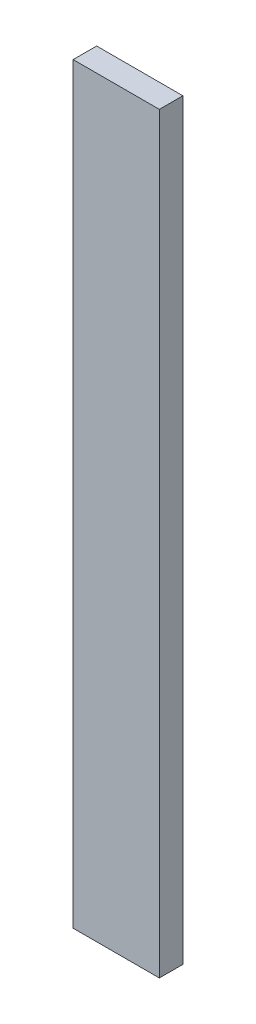
ISO-10303-21;
HEADER;
FILE_DESCRIPTION(('STEP AP214'),'2;1');
FILE_NAME('part.step','',(''),(''),'','','');
FILE_SCHEMA(('AUTOMOTIVE_DESIGN { 1 0 10303 214 1 1 1 1 }'));
ENDSEC;
DATA;
#1=APPLICATION_CONTEXT('core data for automotive mechanical design processes');
#2=APPLICATION_PROTOCOL_DEFINITION('international standard','automotive_design',2000,#1);
#3=PRODUCT_CONTEXT('',#1,'mechanical');
#4=PRODUCT('Part','Part','',(#3));
#5=PRODUCT_RELATED_PRODUCT_CATEGORY('part','',(#4));
#6=PRODUCT_DEFINITION_FORMATION('','',#4);
#7=PRODUCT_DEFINITION_CONTEXT('part definition',#1,'design');
#8=PRODUCT_DEFINITION('design','',#6,#7);
#9=PRODUCT_DEFINITION_SHAPE('','',#8);
#10=(LENGTH_UNIT() NAMED_UNIT(*) SI_UNIT(.MILLI.,.METRE.));
#11=(NAMED_UNIT(*) PLANE_ANGLE_UNIT() SI_UNIT($,.RADIAN.));
#12=(NAMED_UNIT(*) SI_UNIT($,.STERADIAN.) SOLID_ANGLE_UNIT());
#13=UNCERTAINTY_MEASURE_WITH_UNIT(LENGTH_MEASURE(1.E-05),#10,'distance_accuracy_value','');
#14=(GEOMETRIC_REPRESENTATION_CONTEXT(3) GLOBAL_UNCERTAINTY_ASSIGNED_CONTEXT((#13)) GLOBAL_UNIT_ASSIGNED_CONTEXT((#10,
#11,#12)) REPRESENTATION_CONTEXT('',''));
#15=CARTESIAN_POINT('',(0.,0.,0.));
#16=DIRECTION('',(0.,0.,1.));
#17=DIRECTION('',(1.,0.,0.));
#18=AXIS2_PLACEMENT_3D('',#15,#16,#17);
#19=CARTESIAN_POINT('',(-69.85,1219.2,19.05));
#20=DIRECTION('',(-1.,0.,0.));
#21=DIRECTION('',(0.,0.,1.));
#22=AXIS2_PLACEMENT_3D('',#19,#20,#21);
#23=PLANE('',#22);
#24=DIRECTION('',(0.,0.,-1.));
#25=VECTOR('',#24,1.);
#26=CARTESIAN_POINT('',(-69.85,0.,19.05));
#27=LINE('',#26,#25);
#28=CARTESIAN_POINT('',(-69.85,0.,19.05));
#29=VERTEX_POINT('',#28);
#30=CARTESIAN_POINT('',(-69.85,0.,-19.05));
#31=VERTEX_POINT('',#30);
#32=EDGE_CURVE('E104',#29,#31,#27,.T.);
#33=ORIENTED_EDGE('',*,*,#32,.F.);
#34=DIRECTION('',(0.,-1.,0.));
#35=VECTOR('',#34,1.);
#36=CARTESIAN_POINT('',(-69.85,1219.2,19.05));
#37=LINE('',#36,#35);
#38=CARTESIAN_POINT('',(-69.85,1219.2,19.05));
#39=VERTEX_POINT('',#38);
#40=EDGE_CURVE('E11',#39,#29,#37,.T.);
#41=ORIENTED_EDGE('',*,*,#40,.F.);
#42=DIRECTION('',(0.,0.,-1.));
#43=VECTOR('',#42,1.);
#44=CARTESIAN_POINT('',(-69.85,1219.2,19.05));
#45=LINE('',#44,#43);
#46=CARTESIAN_POINT('',(-69.85,1219.2,-19.05));
#47=VERTEX_POINT('',#46);
#48=EDGE_CURVE('E99',#39,#47,#45,.T.);
#49=ORIENTED_EDGE('',*,*,#48,.T.);
#50=DIRECTION('',(0.,-1.,0.));
#51=VECTOR('',#50,1.);
#52=CARTESIAN_POINT('',(-69.85,1219.2,-19.05));
#53=LINE('',#52,#51);
#54=EDGE_CURVE('E42',#47,#31,#53,.T.);
#55=ORIENTED_EDGE('',*,*,#54,.T.);
#56=EDGE_LOOP('',(#33,#41,#49,#55));
#57=FACE_BOUND('',#56,.T.);
#58=ADVANCED_FACE('F39',(#57),#23,.T.);
#59=CARTESIAN_POINT('',(-69.85,1219.2,19.05));
#60=DIRECTION('',(0.,0.,-1.));
#61=DIRECTION('',(-1.,0.,0.));
#62=AXIS2_PLACEMENT_3D('',#59,#60,#61);
#63=PLANE('',#62);
#64=DIRECTION('',(1.,0.,0.));
#65=VECTOR('',#64,1.);
#66=CARTESIAN_POINT('',(-69.85,0.,19.05));
#67=LINE('',#66,#65);
#68=CARTESIAN_POINT('',(69.85,0.,19.05));
#69=VERTEX_POINT('',#68);
#70=EDGE_CURVE('E72',#29,#69,#67,.T.);
#71=ORIENTED_EDGE('',*,*,#70,.T.);
#72=DIRECTION('',(0.,-1.,0.));
#73=VECTOR('',#72,1.);
#74=CARTESIAN_POINT('',(69.85,1219.2,19.05));
#75=LINE('',#74,#73);
#76=CARTESIAN_POINT('',(69.85,1219.2,19.05));
#77=VERTEX_POINT('',#76);
#78=EDGE_CURVE('E48',#77,#69,#75,.T.);
#79=ORIENTED_EDGE('',*,*,#78,.F.);
#80=DIRECTION('',(1.,0.,0.));
#81=VECTOR('',#80,1.);
#82=CARTESIAN_POINT('',(-69.85,1219.2,19.05));
#83=LINE('',#82,#81);
#84=EDGE_CURVE('E89',#39,#77,#83,.T.);
#85=ORIENTED_EDGE('',*,*,#84,.F.);
#86=ORIENTED_EDGE('',*,*,#40,.T.);
#87=EDGE_LOOP('',(#71,#79,#85,#86));
#88=FACE_BOUND('',#87,.T.);
#89=ADVANCED_FACE('F114',(#88),#63,.F.);
#90=CARTESIAN_POINT('',(69.85,1219.2,19.05));
#91=DIRECTION('',(-1.,0.,0.));
#92=DIRECTION('',(0.,0.,1.));
#93=AXIS2_PLACEMENT_3D('',#90,#91,#92);
#94=PLANE('',#93);
#95=DIRECTION('',(0.,0.,-1.));
#96=VECTOR('',#95,1.);
#97=CARTESIAN_POINT('',(69.85,0.,19.05));
#98=LINE('',#97,#96);
#99=CARTESIAN_POINT('',(69.85,0.,-19.05));
#100=VERTEX_POINT('',#99);
#101=EDGE_CURVE('E96',#69,#100,#98,.T.);
#102=ORIENTED_EDGE('',*,*,#101,.T.);
#103=DIRECTION('',(0.,-1.,0.));
#104=VECTOR('',#103,1.);
#105=CARTESIAN_POINT('',(69.85,1219.2,-19.05));
#106=LINE('',#105,#104);
#107=CARTESIAN_POINT('',(69.85,1219.2,-19.05));
#108=VERTEX_POINT('',#107);
#109=EDGE_CURVE('E93',#108,#100,#106,.T.);
#110=ORIENTED_EDGE('',*,*,#109,.F.);
#111=DIRECTION('',(0.,0.,-1.));
#112=VECTOR('',#111,1.);
#113=CARTESIAN_POINT('',(69.85,1219.2,19.05));
#114=LINE('',#113,#112);
#115=EDGE_CURVE('E84',#77,#108,#114,.T.);
#116=ORIENTED_EDGE('',*,*,#115,.F.);
#117=ORIENTED_EDGE('',*,*,#78,.T.);
#118=EDGE_LOOP('',(#102,#110,#116,#117));
#119=FACE_BOUND('',#118,.T.);
#120=ADVANCED_FACE('F94',(#119),#94,.F.);
#121=CARTESIAN_POINT('',(-69.85,1219.2,-19.05));
#122=DIRECTION('',(0.,0.,-1.));
#123=DIRECTION('',(-1.,0.,0.));
#124=AXIS2_PLACEMENT_3D('',#121,#122,#123);
#125=PLANE('',#124);
#126=DIRECTION('',(1.,0.,0.));
#127=VECTOR('',#126,1.);
#128=CARTESIAN_POINT('',(-69.85,0.,-19.05));
#129=LINE('',#128,#127);
#130=EDGE_CURVE('E107',#31,#100,#129,.T.);
#131=ORIENTED_EDGE('',*,*,#130,.F.);
#132=ORIENTED_EDGE('',*,*,#54,.F.);
#133=DIRECTION('',(1.,0.,0.));
#134=VECTOR('',#133,1.);
#135=CARTESIAN_POINT('',(-69.85,1219.2,-19.05));
#136=LINE('',#135,#134);
#137=EDGE_CURVE('E88',#47,#108,#136,.T.);
#138=ORIENTED_EDGE('',*,*,#137,.T.);
#139=ORIENTED_EDGE('',*,*,#109,.T.);
#140=EDGE_LOOP('',(#131,#132,#138,#139));
#141=FACE_BOUND('',#140,.T.);
#142=ADVANCED_FACE('F98',(#141),#125,.T.);
#143=CARTESIAN_POINT('',(0.,1219.2,0.));
#144=DIRECTION('',(0.,-1.,0.));
#145=DIRECTION('',(0.,0.,-1.));
#146=AXIS2_PLACEMENT_3D('',#143,#144,#145);
#147=PLANE('',#146);
#148=ORIENTED_EDGE('',*,*,#48,.F.);
#149=ORIENTED_EDGE('',*,*,#84,.T.);
#150=ORIENTED_EDGE('',*,*,#115,.T.);
#151=ORIENTED_EDGE('',*,*,#137,.F.);
#152=EDGE_LOOP('',(#148,#149,#150,#151));
#153=FACE_BOUND('',#152,.T.);
#154=ADVANCED_FACE('F87',(#153),#147,.F.);
#155=CARTESIAN_POINT('',(0.,0.,0.));
#156=DIRECTION('',(0.,-1.,0.));
#157=DIRECTION('',(0.,0.,-1.));
#158=AXIS2_PLACEMENT_3D('',#155,#156,#157);
#159=PLANE('',#158);
#160=ORIENTED_EDGE('',*,*,#32,.T.);
#161=ORIENTED_EDGE('',*,*,#130,.T.);
#162=ORIENTED_EDGE('',*,*,#101,.F.);
#163=ORIENTED_EDGE('',*,*,#70,.F.);
#164=EDGE_LOOP('',(#160,#161,#162,#163));
#165=FACE_BOUND('',#164,.T.);
#166=ADVANCED_FACE('F112',(#165),#159,.T.);
#167=CLOSED_SHELL('',(#58,#89,#120,#142,#154,#166));
#168=MANIFOLD_SOLID_BREP('B2',#167);
#169=ADVANCED_BREP_SHAPE_REPRESENTATION('',(#18,#168),#14);
#170=SHAPE_DEFINITION_REPRESENTATION(#9,#169);
ENDSEC;
END-ISO-10303-21;
